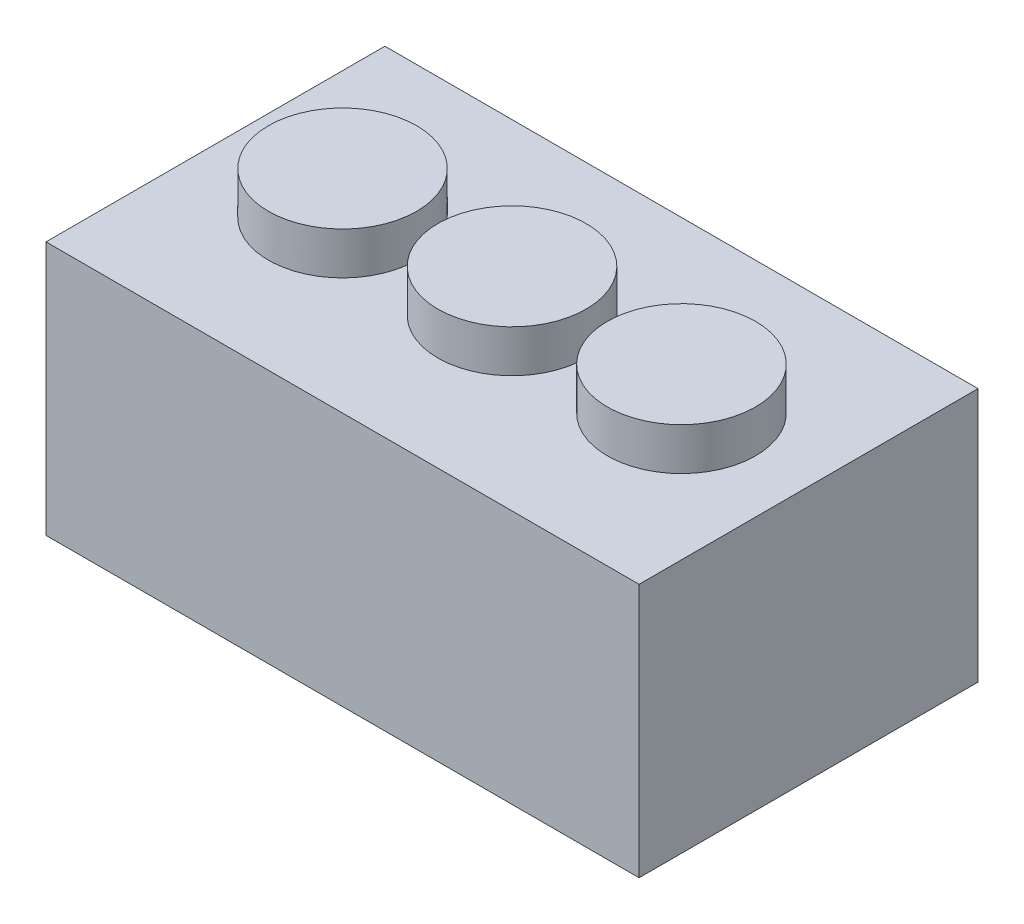
ISO-10303-21;
HEADER;
FILE_DESCRIPTION(('STEP AP214'),'2;1');
FILE_NAME('part.step','',(''),(''),'','','');
FILE_SCHEMA(('AUTOMOTIVE_DESIGN { 1 0 10303 214 1 1 1 1 }'));
ENDSEC;
DATA;
#1=APPLICATION_CONTEXT('core data for automotive mechanical design processes');
#2=APPLICATION_PROTOCOL_DEFINITION('international standard','automotive_design',2000,#1);
#3=PRODUCT_CONTEXT('',#1,'mechanical');
#4=PRODUCT('Part','Part','',(#3));
#5=PRODUCT_RELATED_PRODUCT_CATEGORY('part','',(#4));
#6=PRODUCT_DEFINITION_FORMATION('','',#4);
#7=PRODUCT_DEFINITION_CONTEXT('part definition',#1,'design');
#8=PRODUCT_DEFINITION('design','',#6,#7);
#9=PRODUCT_DEFINITION_SHAPE('','',#8);
#10=(LENGTH_UNIT() NAMED_UNIT(*) SI_UNIT(.MILLI.,.METRE.));
#11=(NAMED_UNIT(*) PLANE_ANGLE_UNIT() SI_UNIT($,.RADIAN.));
#12=(NAMED_UNIT(*) SI_UNIT($,.STERADIAN.) SOLID_ANGLE_UNIT());
#13=UNCERTAINTY_MEASURE_WITH_UNIT(LENGTH_MEASURE(1.E-05),#10,'distance_accuracy_value','');
#14=(GEOMETRIC_REPRESENTATION_CONTEXT(3) GLOBAL_UNCERTAINTY_ASSIGNED_CONTEXT((#13)) GLOBAL_UNIT_ASSIGNED_CONTEXT((#10,
#11,#12)) REPRESENTATION_CONTEXT('',''));
#15=CARTESIAN_POINT('',(0.,0.,0.));
#16=DIRECTION('',(0.,0.,1.));
#17=DIRECTION('',(1.,0.,0.));
#18=AXIS2_PLACEMENT_3D('',#15,#16,#17);
#19=CARTESIAN_POINT('',(68.,60.,40.));
#20=DIRECTION('',(-1.,0.,0.));
#21=DIRECTION('',(0.,0.,1.));
#22=AXIS2_PLACEMENT_3D('',#19,#20,#21);
#23=PLANE('',#22);
#24=DIRECTION('',(0.,0.,-1.));
#25=VECTOR('',#24,1.);
#26=CARTESIAN_POINT('',(68.,0.,0.));
#27=LINE('',#26,#25);
#28=CARTESIAN_POINT('',(68.,0.,-2.));
#29=VERTEX_POINT('',#28);
#30=CARTESIAN_POINT('',(68.,0.,-38.));
#31=VERTEX_POINT('',#30);
#32=EDGE_CURVE('E55',#29,#31,#27,.T.);
#33=ORIENTED_EDGE('',*,*,#32,.F.);
#34=DIRECTION('',(0.,1.,0.));
#35=VECTOR('',#34,1.);
#36=CARTESIAN_POINT('',(68.,-141.481447547019,-2.));
#37=LINE('',#36,#35);
#38=CARTESIAN_POINT('',(68.,58.,-2.));
#39=VERTEX_POINT('',#38);
#40=EDGE_CURVE('E186',#29,#39,#37,.T.);
#41=ORIENTED_EDGE('',*,*,#40,.T.);
#42=DIRECTION('',(0.,0.,-1.));
#43=VECTOR('',#42,1.);
#44=CARTESIAN_POINT('',(68.,58.,0.));
#45=LINE('',#44,#43);
#46=CARTESIAN_POINT('',(68.,58.,-38.));
#47=VERTEX_POINT('',#46);
#48=EDGE_CURVE('E290',#39,#47,#45,.T.);
#49=ORIENTED_EDGE('',*,*,#48,.T.);
#50=DIRECTION('',(0.,-1.,0.));
#51=VECTOR('',#50,1.);
#52=CARTESIAN_POINT('',(68.,60.,-38.));
#53=LINE('',#52,#51);
#54=EDGE_CURVE('E281',#47,#31,#53,.T.);
#55=ORIENTED_EDGE('',*,*,#54,.T.);
#56=EDGE_LOOP('',(#33,#41,#49,#55));
#57=FACE_BOUND('',#56,.T.);
#58=ADVANCED_FACE('F39',(#57),#23,.T.);
#59=CARTESIAN_POINT('',(68.,58.,38.));
#60=VERTEX_POINT('',#59);
#61=CARTESIAN_POINT('',(68.,58.,2.));
#62=VERTEX_POINT('',#61);
#63=EDGE_CURVE('E286',#60,#62,#45,.T.);
#64=ORIENTED_EDGE('',*,*,#63,.T.);
#65=DIRECTION('',(0.,1.,0.));
#66=VECTOR('',#65,1.);
#67=CARTESIAN_POINT('',(68.,-141.481447547019,2.));
#68=LINE('',#67,#66);
#69=CARTESIAN_POINT('',(68.,0.,2.));
#70=VERTEX_POINT('',#69);
#71=EDGE_CURVE('E63',#70,#62,#68,.T.);
#72=ORIENTED_EDGE('',*,*,#71,.F.);
#73=CARTESIAN_POINT('',(68.,0.,38.));
#74=VERTEX_POINT('',#73);
#75=EDGE_CURVE('E334',#74,#70,#27,.T.);
#76=ORIENTED_EDGE('',*,*,#75,.F.);
#77=DIRECTION('',(0.,-1.,0.));
#78=VECTOR('',#77,1.);
#79=CARTESIAN_POINT('',(68.,60.,38.));
#80=LINE('',#79,#78);
#81=EDGE_CURVE('E291',#60,#74,#80,.T.);
#82=ORIENTED_EDGE('',*,*,#81,.F.);
#83=EDGE_LOOP('',(#64,#72,#76,#82));
#84=FACE_BOUND('',#83,.T.);
#85=ADVANCED_FACE('F450',(#84),#23,.T.);
#86=CARTESIAN_POINT('',(-68.,60.,40.));
#87=DIRECTION('',(1.,0.,0.));
#88=DIRECTION('',(0.,0.,-1.));
#89=AXIS2_PLACEMENT_3D('',#86,#87,#88);
#90=PLANE('',#89);
#91=DIRECTION('',(0.,0.,1.));
#92=VECTOR('',#91,1.);
#93=CARTESIAN_POINT('',(-68.,58.,0.));
#94=LINE('',#93,#92);
#95=CARTESIAN_POINT('',(-68.,58.,-38.));
#96=VERTEX_POINT('',#95);
#97=CARTESIAN_POINT('',(-68.,58.,-2.));
#98=VERTEX_POINT('',#97);
#99=EDGE_CURVE('E305',#96,#98,#94,.T.);
#100=ORIENTED_EDGE('',*,*,#99,.T.);
#101=DIRECTION('',(0.,1.,0.));
#102=VECTOR('',#101,1.);
#103=CARTESIAN_POINT('',(-68.,-141.481447547019,-2.));
#104=LINE('',#103,#102);
#105=CARTESIAN_POINT('',(-68.,0.,-2.));
#106=VERTEX_POINT('',#105);
#107=EDGE_CURVE('E259',#106,#98,#104,.T.);
#108=ORIENTED_EDGE('',*,*,#107,.F.);
#109=DIRECTION('',(0.,0.,1.));
#110=VECTOR('',#109,1.);
#111=CARTESIAN_POINT('',(-68.,0.,0.));
#112=LINE('',#111,#110);
#113=CARTESIAN_POINT('',(-68.,0.,-38.));
#114=VERTEX_POINT('',#113);
#115=EDGE_CURVE('E342',#114,#106,#112,.T.);
#116=ORIENTED_EDGE('',*,*,#115,.F.);
#117=DIRECTION('',(0.,-1.,0.));
#118=VECTOR('',#117,1.);
#119=CARTESIAN_POINT('',(-68.,60.,-38.));
#120=LINE('',#119,#118);
#121=EDGE_CURVE('E285',#96,#114,#120,.T.);
#122=ORIENTED_EDGE('',*,*,#121,.F.);
#123=EDGE_LOOP('',(#100,#108,#116,#122));
#124=FACE_BOUND('',#123,.T.);
#125=ADVANCED_FACE('F455',(#124),#90,.T.);
#126=CARTESIAN_POINT('',(-68.,0.,2.));
#127=VERTEX_POINT('',#126);
#128=CARTESIAN_POINT('',(-68.,0.,38.));
#129=VERTEX_POINT('',#128);
#130=EDGE_CURVE('E345',#127,#129,#112,.T.);
#131=ORIENTED_EDGE('',*,*,#130,.F.);
#132=DIRECTION('',(0.,1.,0.));
#133=VECTOR('',#132,1.);
#134=CARTESIAN_POINT('',(-68.,-141.481447547019,2.));
#135=LINE('',#134,#133);
#136=CARTESIAN_POINT('',(-68.,58.,2.));
#137=VERTEX_POINT('',#136);
#138=EDGE_CURVE('E263',#127,#137,#135,.T.);
#139=ORIENTED_EDGE('',*,*,#138,.T.);
#140=CARTESIAN_POINT('',(-68.,58.,38.));
#141=VERTEX_POINT('',#140);
#142=EDGE_CURVE('E301',#137,#141,#94,.T.);
#143=ORIENTED_EDGE('',*,*,#142,.T.);
#144=DIRECTION('',(0.,-1.,0.));
#145=VECTOR('',#144,1.);
#146=CARTESIAN_POINT('',(-68.,60.,38.));
#147=LINE('',#146,#145);
#148=EDGE_CURVE('E294',#141,#129,#147,.T.);
#149=ORIENTED_EDGE('',*,*,#148,.T.);
#150=EDGE_LOOP('',(#131,#139,#143,#149));
#151=FACE_BOUND('',#150,.T.);
#152=ADVANCED_FACE('F468',(#151),#90,.T.);
#153=CARTESIAN_POINT('',(0.,58.,0.));
#154=DIRECTION('',(0.,-1.,0.));
#155=DIRECTION('',(0.,0.,-1.));
#156=AXIS2_PLACEMENT_3D('',#153,#154,#155);
#157=PLANE('',#156);
#158=ORIENTED_EDGE('',*,*,#48,.F.);
#159=DIRECTION('',(1.,0.,0.));
#160=VECTOR('',#159,1.);
#161=CARTESIAN_POINT('',(19.3971647412708,58.,-2.));
#162=LINE('',#161,#160);
#163=CARTESIAN_POINT('',(55.3704261489394,58.,-2.));
#164=VERTEX_POINT('',#163);
#165=EDGE_CURVE('E248',#164,#39,#162,.T.);
#166=ORIENTED_EDGE('',*,*,#165,.F.);
#167=CARTESIAN_POINT('',(40.,58.,0.));
#168=DIRECTION('',(0.,-1.,0.));
#169=DIRECTION('',(0.,0.,-1.));
#170=AXIS2_PLACEMENT_3D('',#167,#168,#169);
#171=CIRCLE('',#170,15.5);
#172=CARTESIAN_POINT('',(24.6295738510606,58.,-2.));
#173=VERTEX_POINT('',#172);
#174=EDGE_CURVE('E317',#164,#173,#171,.F.);
#175=ORIENTED_EDGE('',*,*,#174,.T.);
#176=CARTESIAN_POINT('',(19.3971647412708,58.,-2.));
#177=VERTEX_POINT('',#176);
#178=EDGE_CURVE('E249',#177,#173,#162,.T.);
#179=ORIENTED_EDGE('',*,*,#178,.F.);
#180=CARTESIAN_POINT('',(0.,58.,0.));
#181=DIRECTION('',(0.,-1.,0.));
#182=DIRECTION('',(0.,0.,-1.));
#183=AXIS2_PLACEMENT_3D('',#180,#181,#182);
#184=CIRCLE('',#183,19.5);
#185=CARTESIAN_POINT('',(-19.3971647412708,58.,-2.));
#186=VERTEX_POINT('',#185);
#187=EDGE_CURVE('E197',#186,#177,#184,.T.);
#188=ORIENTED_EDGE('',*,*,#187,.F.);
#189=DIRECTION('',(1.,0.,0.));
#190=VECTOR('',#189,1.);
#191=CARTESIAN_POINT('',(-68.,58.,-2.));
#192=LINE('',#191,#190);
#193=CARTESIAN_POINT('',(-24.6295738510606,58.,-2.));
#194=VERTEX_POINT('',#193);
#195=EDGE_CURVE('E239',#194,#186,#192,.T.);
#196=ORIENTED_EDGE('',*,*,#195,.F.);
#197=CARTESIAN_POINT('',(-40.,58.,0.));
#198=DIRECTION('',(0.,-1.,0.));
#199=DIRECTION('',(0.,0.,-1.));
#200=AXIS2_PLACEMENT_3D('',#197,#198,#199);
#201=CIRCLE('',#200,15.5);
#202=CARTESIAN_POINT('',(-55.3704261489394,58.,-2.));
#203=VERTEX_POINT('',#202);
#204=EDGE_CURVE('E284',#194,#203,#201,.F.);
#205=ORIENTED_EDGE('',*,*,#204,.T.);
#206=EDGE_CURVE('E241',#98,#203,#192,.T.);
#207=ORIENTED_EDGE('',*,*,#206,.F.);
#208=ORIENTED_EDGE('',*,*,#99,.F.);
#209=DIRECTION('',(-1.,0.,0.));
#210=VECTOR('',#209,1.);
#211=CARTESIAN_POINT('',(0.,58.,-38.));
#212=LINE('',#211,#210);
#213=EDGE_CURVE('E289',#47,#96,#212,.T.);
#214=ORIENTED_EDGE('',*,*,#213,.F.);
#215=EDGE_LOOP('',(#158,#166,#175,#179,#188,#196,#205,#207,#208,#214));
#216=FACE_BOUND('',#215,.T.);
#217=ADVANCED_FACE('F445',(#216),#157,.T.);
#218=ORIENTED_EDGE('',*,*,#142,.F.);
#219=DIRECTION('',(-1.,0.,0.));
#220=VECTOR('',#219,1.);
#221=CARTESIAN_POINT('',(-68.,58.,2.));
#222=LINE('',#221,#220);
#223=CARTESIAN_POINT('',(-55.3704261489394,58.,2.));
#224=VERTEX_POINT('',#223);
#225=EDGE_CURVE('E234',#224,#137,#222,.T.);
#226=ORIENTED_EDGE('',*,*,#225,.F.);
#227=CARTESIAN_POINT('',(-24.6295738510606,58.,2.));
#228=VERTEX_POINT('',#227);
#229=EDGE_CURVE('E322',#224,#228,#201,.F.);
#230=ORIENTED_EDGE('',*,*,#229,.T.);
#231=CARTESIAN_POINT('',(-19.3971647412708,58.,2.));
#232=VERTEX_POINT('',#231);
#233=EDGE_CURVE('E235',#232,#228,#222,.T.);
#234=ORIENTED_EDGE('',*,*,#233,.F.);
#235=CARTESIAN_POINT('',(0.,58.,0.));
#236=DIRECTION('',(0.,-1.,0.));
#237=DIRECTION('',(0.,0.,-1.));
#238=AXIS2_PLACEMENT_3D('',#235,#236,#237);
#239=CIRCLE('',#238,19.5);
#240=CARTESIAN_POINT('',(19.3971647412708,58.,2.));
#241=VERTEX_POINT('',#240);
#242=EDGE_CURVE('E229',#241,#232,#239,.T.);
#243=ORIENTED_EDGE('',*,*,#242,.F.);
#244=DIRECTION('',(-1.,0.,0.));
#245=VECTOR('',#244,1.);
#246=CARTESIAN_POINT('',(19.3971647412708,58.,2.));
#247=LINE('',#246,#245);
#248=CARTESIAN_POINT('',(24.6295738510606,58.,2.));
#249=VERTEX_POINT('',#248);
#250=EDGE_CURVE('E224',#249,#241,#247,.T.);
#251=ORIENTED_EDGE('',*,*,#250,.F.);
#252=CARTESIAN_POINT('',(55.3704261489394,58.,2.));
#253=VERTEX_POINT('',#252);
#254=EDGE_CURVE('E316',#249,#253,#171,.F.);
#255=ORIENTED_EDGE('',*,*,#254,.T.);
#256=EDGE_CURVE('E225',#62,#253,#247,.T.);
#257=ORIENTED_EDGE('',*,*,#256,.F.);
#258=ORIENTED_EDGE('',*,*,#63,.F.);
#259=DIRECTION('',(1.,0.,0.));
#260=VECTOR('',#259,1.);
#261=CARTESIAN_POINT('',(0.,58.,38.));
#262=LINE('',#261,#260);
#263=EDGE_CURVE('E295',#141,#60,#262,.T.);
#264=ORIENTED_EDGE('',*,*,#263,.F.);
#265=EDGE_LOOP('',(#218,#226,#230,#234,#243,#251,#255,#257,#258,#264));
#266=FACE_BOUND('',#265,.T.);
#267=ADVANCED_FACE('F438',(#266),#157,.T.);
#268=CARTESIAN_POINT('',(0.,0.,0.));
#269=DIRECTION('',(0.,-1.,0.));
#270=DIRECTION('',(0.,0.,-1.));
#271=AXIS2_PLACEMENT_3D('',#268,#269,#270);
#272=PLANE('',#271);
#273=ORIENTED_EDGE('',*,*,#75,.T.);
#274=DIRECTION('',(-1.,0.,0.));
#275=VECTOR('',#274,1.);
#276=CARTESIAN_POINT('',(19.3971647412708,0.,2.));
#277=LINE('',#276,#275);
#278=CARTESIAN_POINT('',(19.3971647412708,0.,2.));
#279=VERTEX_POINT('',#278);
#280=EDGE_CURVE('E220',#70,#279,#277,.T.);
#281=ORIENTED_EDGE('',*,*,#280,.T.);
#282=CARTESIAN_POINT('',(0.,0.,0.));
#283=DIRECTION('',(0.,-1.,0.));
#284=DIRECTION('',(0.,0.,-1.));
#285=AXIS2_PLACEMENT_3D('',#282,#283,#284);
#286=CIRCLE('',#285,19.5);
#287=CARTESIAN_POINT('',(-19.3971647412708,0.,2.));
#288=VERTEX_POINT('',#287);
#289=EDGE_CURVE('E216',#279,#288,#286,.T.);
#290=ORIENTED_EDGE('',*,*,#289,.T.);
#291=DIRECTION('',(-1.,0.,0.));
#292=VECTOR('',#291,1.);
#293=CARTESIAN_POINT('',(-68.,0.,2.));
#294=LINE('',#293,#292);
#295=EDGE_CURVE('E210',#288,#127,#294,.T.);
#296=ORIENTED_EDGE('',*,*,#295,.T.);
#297=ORIENTED_EDGE('',*,*,#130,.T.);
#298=DIRECTION('',(1.,0.,0.));
#299=VECTOR('',#298,1.);
#300=CARTESIAN_POINT('',(0.,0.,38.));
#301=LINE('',#300,#299);
#302=EDGE_CURVE('E338',#129,#74,#301,.T.);
#303=ORIENTED_EDGE('',*,*,#302,.T.);
#304=EDGE_LOOP('',(#273,#281,#290,#296,#297,#303));
#305=FACE_BOUND('',#304,.T.);
#306=DIRECTION('',(0.,0.,-1.));
#307=VECTOR('',#306,1.);
#308=CARTESIAN_POINT('',(70.,0.,40.));
#309=LINE('',#308,#307);
#310=CARTESIAN_POINT('',(70.,0.,40.));
#311=VERTEX_POINT('',#310);
#312=CARTESIAN_POINT('',(70.,0.,-40.));
#313=VERTEX_POINT('',#312);
#314=EDGE_CURVE('E360',#311,#313,#309,.T.);
#315=ORIENTED_EDGE('',*,*,#314,.F.);
#316=DIRECTION('',(1.,0.,0.));
#317=VECTOR('',#316,1.);
#318=CARTESIAN_POINT('',(-70.,0.,40.));
#319=LINE('',#318,#317);
#320=CARTESIAN_POINT('',(-70.,0.,40.));
#321=VERTEX_POINT('',#320);
#322=EDGE_CURVE('E371',#321,#311,#319,.T.);
#323=ORIENTED_EDGE('',*,*,#322,.F.);
#324=DIRECTION('',(0.,0.,1.));
#325=VECTOR('',#324,1.);
#326=CARTESIAN_POINT('',(-70.,0.,40.));
#327=LINE('',#326,#325);
#328=CARTESIAN_POINT('',(-70.,0.,-40.));
#329=VERTEX_POINT('',#328);
#330=EDGE_CURVE('E387',#329,#321,#327,.T.);
#331=ORIENTED_EDGE('',*,*,#330,.F.);
#332=DIRECTION('',(-1.,0.,0.));
#333=VECTOR('',#332,1.);
#334=CARTESIAN_POINT('',(-70.,0.,-40.));
#335=LINE('',#334,#333);
#336=EDGE_CURVE('E384',#313,#329,#335,.T.);
#337=ORIENTED_EDGE('',*,*,#336,.F.);
#338=EDGE_LOOP('',(#315,#323,#331,#337));
#339=FACE_BOUND('',#338,.T.);
#340=DIRECTION('',(1.,0.,0.));
#341=VECTOR('',#340,1.);
#342=CARTESIAN_POINT('',(19.3971647412708,0.,-2.));
#343=LINE('',#342,#341);
#344=CARTESIAN_POINT('',(19.3971647412708,0.,-2.));
#345=VERTEX_POINT('',#344);
#346=EDGE_CURVE('E179',#345,#29,#343,.T.);
#347=ORIENTED_EDGE('',*,*,#346,.T.);
#348=ORIENTED_EDGE('',*,*,#32,.T.);
#349=DIRECTION('',(-1.,0.,0.));
#350=VECTOR('',#349,1.);
#351=CARTESIAN_POINT('',(0.,0.,-38.));
#352=LINE('',#351,#350);
#353=EDGE_CURVE('E337',#31,#114,#352,.T.);
#354=ORIENTED_EDGE('',*,*,#353,.T.);
#355=ORIENTED_EDGE('',*,*,#115,.T.);
#356=DIRECTION('',(1.,0.,0.));
#357=VECTOR('',#356,1.);
#358=CARTESIAN_POINT('',(-68.,0.,-2.));
#359=LINE('',#358,#357);
#360=CARTESIAN_POINT('',(-19.3971647412708,0.,-2.));
#361=VERTEX_POINT('',#360);
#362=EDGE_CURVE('E206',#106,#361,#359,.T.);
#363=ORIENTED_EDGE('',*,*,#362,.T.);
#364=CARTESIAN_POINT('',(0.,0.,0.));
#365=DIRECTION('',(0.,-1.,0.));
#366=DIRECTION('',(0.,0.,-1.));
#367=AXIS2_PLACEMENT_3D('',#364,#365,#366);
#368=CIRCLE('',#367,19.5);
#369=EDGE_CURVE('E190',#361,#345,#368,.T.);
#370=ORIENTED_EDGE('',*,*,#369,.T.);
#371=EDGE_LOOP('',(#347,#348,#354,#355,#363,#370));
#372=FACE_BOUND('',#371,.T.);
#373=CARTESIAN_POINT('',(0.,0.,0.));
#374=DIRECTION('',(0.,-1.,0.));
#375=DIRECTION('',(0.,0.,-1.));
#376=AXIS2_PLACEMENT_3D('',#373,#374,#375);
#377=CIRCLE('',#376,15.5);
#378=CARTESIAN_POINT('',(0.,0.,-15.5));
#379=VERTEX_POINT('',#378);
#380=EDGE_CURVE('E191',#379,#379,#377,.T.);
#381=ORIENTED_EDGE('',*,*,#380,.F.);
#382=EDGE_LOOP('',(#381));
#383=FACE_BOUND('',#382,.T.);
#384=ADVANCED_FACE('F202',(#305,#339,#372,#383),#272,.T.);
#385=CARTESIAN_POINT('',(70.,60.,40.));
#386=DIRECTION('',(-1.,0.,0.));
#387=DIRECTION('',(0.,0.,1.));
#388=AXIS2_PLACEMENT_3D('',#385,#386,#387);
#389=PLANE('',#388);
#390=ORIENTED_EDGE('',*,*,#314,.T.);
#391=DIRECTION('',(0.,-1.,0.));
#392=VECTOR('',#391,1.);
#393=CARTESIAN_POINT('',(70.,60.,-40.));
#394=LINE('',#393,#392);
#395=CARTESIAN_POINT('',(70.,60.,-40.));
#396=VERTEX_POINT('',#395);
#397=EDGE_CURVE('E365',#396,#313,#394,.T.);
#398=ORIENTED_EDGE('',*,*,#397,.F.);
#399=DIRECTION('',(0.,0.,-1.));
#400=VECTOR('',#399,1.);
#401=CARTESIAN_POINT('',(70.,60.,40.));
#402=LINE('',#401,#400);
#403=CARTESIAN_POINT('',(70.,60.,40.));
#404=VERTEX_POINT('',#403);
#405=EDGE_CURVE('E366',#404,#396,#402,.T.);
#406=ORIENTED_EDGE('',*,*,#405,.F.);
#407=DIRECTION('',(0.,-1.,0.));
#408=VECTOR('',#407,1.);
#409=CARTESIAN_POINT('',(70.,60.,40.));
#410=LINE('',#409,#408);
#411=EDGE_CURVE('E380',#404,#311,#410,.T.);
#412=ORIENTED_EDGE('',*,*,#411,.T.);
#413=EDGE_LOOP('',(#390,#398,#406,#412));
#414=FACE_BOUND('',#413,.T.);
#415=ADVANCED_FACE('F41',(#414),#389,.F.);
#416=CARTESIAN_POINT('',(-70.,60.,-40.));
#417=DIRECTION('',(0.,0.,1.));
#418=DIRECTION('',(1.,0.,0.));
#419=AXIS2_PLACEMENT_3D('',#416,#417,#418);
#420=PLANE('',#419);
#421=ORIENTED_EDGE('',*,*,#336,.T.);
#422=DIRECTION('',(0.,-1.,0.));
#423=VECTOR('',#422,1.);
#424=CARTESIAN_POINT('',(-70.,60.,-40.));
#425=LINE('',#424,#423);
#426=CARTESIAN_POINT('',(-70.,60.,-40.));
#427=VERTEX_POINT('',#426);
#428=EDGE_CURVE('E399',#427,#329,#425,.T.);
#429=ORIENTED_EDGE('',*,*,#428,.F.);
#430=DIRECTION('',(-1.,0.,0.));
#431=VECTOR('',#430,1.);
#432=CARTESIAN_POINT('',(-70.,60.,-40.));
#433=LINE('',#432,#431);
#434=EDGE_CURVE('E370',#396,#427,#433,.T.);
#435=ORIENTED_EDGE('',*,*,#434,.F.);
#436=ORIENTED_EDGE('',*,*,#397,.T.);
#437=EDGE_LOOP('',(#421,#429,#435,#436));
#438=FACE_BOUND('',#437,.T.);
#439=ADVANCED_FACE('F428',(#438),#420,.F.);
#440=CARTESIAN_POINT('',(-70.,60.,40.));
#441=DIRECTION('',(1.,0.,0.));
#442=DIRECTION('',(0.,0.,-1.));
#443=AXIS2_PLACEMENT_3D('',#440,#441,#442);
#444=PLANE('',#443);
#445=ORIENTED_EDGE('',*,*,#330,.T.);
#446=DIRECTION('',(0.,-1.,0.));
#447=VECTOR('',#446,1.);
#448=CARTESIAN_POINT('',(-70.,60.,40.));
#449=LINE('',#448,#447);
#450=CARTESIAN_POINT('',(-70.,60.,40.));
#451=VERTEX_POINT('',#450);
#452=EDGE_CURVE('E395',#451,#321,#449,.T.);
#453=ORIENTED_EDGE('',*,*,#452,.F.);
#454=DIRECTION('',(0.,0.,1.));
#455=VECTOR('',#454,1.);
#456=CARTESIAN_POINT('',(-70.,60.,40.));
#457=LINE('',#456,#455);
#458=EDGE_CURVE('E374',#427,#451,#457,.T.);
#459=ORIENTED_EDGE('',*,*,#458,.F.);
#460=ORIENTED_EDGE('',*,*,#428,.T.);
#461=EDGE_LOOP('',(#445,#453,#459,#460));
#462=FACE_BOUND('',#461,.T.);
#463=ADVANCED_FACE('F433',(#462),#444,.F.);
#464=CARTESIAN_POINT('',(-70.,60.,40.));
#465=DIRECTION('',(0.,0.,-1.));
#466=DIRECTION('',(-1.,0.,0.));
#467=AXIS2_PLACEMENT_3D('',#464,#465,#466);
#468=PLANE('',#467);
#469=ORIENTED_EDGE('',*,*,#322,.T.);
#470=ORIENTED_EDGE('',*,*,#411,.F.);
#471=DIRECTION('',(1.,0.,0.));
#472=VECTOR('',#471,1.);
#473=CARTESIAN_POINT('',(-70.,60.,40.));
#474=LINE('',#473,#472);
#475=EDGE_CURVE('E377',#451,#404,#474,.T.);
#476=ORIENTED_EDGE('',*,*,#475,.F.);
#477=ORIENTED_EDGE('',*,*,#452,.T.);
#478=EDGE_LOOP('',(#469,#470,#476,#477));
#479=FACE_BOUND('',#478,.T.);
#480=ADVANCED_FACE('F415',(#479),#468,.F.);
#481=CARTESIAN_POINT('',(0.,60.,0.));
#482=DIRECTION('',(0.,-1.,0.));
#483=DIRECTION('',(0.,0.,-1.));
#484=AXIS2_PLACEMENT_3D('',#481,#482,#483);
#485=PLANE('',#484);
#486=CARTESIAN_POINT('',(40.,60.,0.));
#487=DIRECTION('',(0.,-1.,0.));
#488=DIRECTION('',(0.,0.,-1.));
#489=AXIS2_PLACEMENT_3D('',#486,#487,#488);
#490=CIRCLE('',#489,17.5);
#491=CARTESIAN_POINT('',(40.,60.,-17.5));
#492=VERTEX_POINT('',#491);
#493=EDGE_CURVE('E11',#492,#492,#490,.F.);
#494=ORIENTED_EDGE('',*,*,#493,.F.);
#495=EDGE_LOOP('',(#494));
#496=FACE_BOUND('',#495,.T.);
#497=CARTESIAN_POINT('',(-40.,60.,0.));
#498=DIRECTION('',(0.,-1.,0.));
#499=DIRECTION('',(0.,0.,-1.));
#500=AXIS2_PLACEMENT_3D('',#497,#498,#499);
#501=CIRCLE('',#500,17.5);
#502=CARTESIAN_POINT('',(-40.,60.,-17.5));
#503=VERTEX_POINT('',#502);
#504=EDGE_CURVE('E48',#503,#503,#501,.F.);
#505=ORIENTED_EDGE('',*,*,#504,.F.);
#506=EDGE_LOOP('',(#505));
#507=FACE_BOUND('',#506,.T.);
#508=CARTESIAN_POINT('',(0.,60.,0.));
#509=DIRECTION('',(0.,1.,0.));
#510=DIRECTION('',(0.,0.,1.));
#511=AXIS2_PLACEMENT_3D('',#508,#509,#510);
#512=CIRCLE('',#511,17.5);
#513=CARTESIAN_POINT('',(0.,60.,17.5));
#514=VERTEX_POINT('',#513);
#515=EDGE_CURVE('E361',#514,#514,#512,.T.);
#516=ORIENTED_EDGE('',*,*,#515,.F.);
#517=EDGE_LOOP('',(#516));
#518=FACE_BOUND('',#517,.T.);
#519=ORIENTED_EDGE('',*,*,#405,.T.);
#520=ORIENTED_EDGE('',*,*,#434,.T.);
#521=ORIENTED_EDGE('',*,*,#458,.T.);
#522=ORIENTED_EDGE('',*,*,#475,.T.);
#523=EDGE_LOOP('',(#519,#520,#521,#522));
#524=FACE_BOUND('',#523,.T.);
#525=ADVANCED_FACE('F411',(#496,#507,#518,#524),#485,.F.);
#526=CARTESIAN_POINT('',(0.,70.,0.));
#527=DIRECTION('',(0.,-1.,0.));
#528=DIRECTION('',(0.,0.,-1.));
#529=AXIS2_PLACEMENT_3D('',#526,#527,#528);
#530=CYLINDRICAL_SURFACE('',#529,17.5);
#531=CARTESIAN_POINT('',(0.,70.,0.));
#532=DIRECTION('',(0.,1.,0.));
#533=DIRECTION('',(0.,0.,1.));
#534=AXIS2_PLACEMENT_3D('',#531,#532,#533);
#535=CIRCLE('',#534,17.5);
#536=CARTESIAN_POINT('',(0.,70.,17.5));
#537=VERTEX_POINT('',#536);
#538=EDGE_CURVE('E356',#537,#537,#535,.T.);
#539=ORIENTED_EDGE('',*,*,#538,.F.);
#540=EDGE_LOOP('',(#539));
#541=FACE_BOUND('',#540,.T.);
#542=ORIENTED_EDGE('',*,*,#515,.T.);
#543=EDGE_LOOP('',(#542));
#544=FACE_BOUND('',#543,.T.);
#545=ADVANCED_FACE('F414',(#541,#544),#530,.T.);
#546=CARTESIAN_POINT('',(0.,70.,0.));
#547=DIRECTION('',(0.,1.,0.));
#548=DIRECTION('',(0.,0.,1.));
#549=AXIS2_PLACEMENT_3D('',#546,#547,#548);
#550=PLANE('',#549);
#551=ORIENTED_EDGE('',*,*,#538,.T.);
#552=EDGE_LOOP('',(#551));
#553=FACE_BOUND('',#552,.T.);
#554=ADVANCED_FACE('F513',(#553),#550,.T.);
#555=CARTESIAN_POINT('',(-40.,70.,0.));
#556=DIRECTION('',(0.,-1.,0.));
#557=DIRECTION('',(0.,0.,-1.));
#558=AXIS2_PLACEMENT_3D('',#555,#556,#557);
#559=CYLINDRICAL_SURFACE('',#558,17.5);
#560=CARTESIAN_POINT('',(-40.,70.,0.));
#561=DIRECTION('',(0.,1.,0.));
#562=DIRECTION('',(0.,0.,1.));
#563=AXIS2_PLACEMENT_3D('',#560,#561,#562);
#564=CIRCLE('',#563,17.5);
#565=CARTESIAN_POINT('',(-40.,70.,17.5));
#566=VERTEX_POINT('',#565);
#567=EDGE_CURVE('E352',#566,#566,#564,.T.);
#568=ORIENTED_EDGE('',*,*,#567,.F.);
#569=EDGE_LOOP('',(#568));
#570=FACE_BOUND('',#569,.T.);
#571=ORIENTED_EDGE('',*,*,#504,.T.);
#572=EDGE_LOOP('',(#571));
#573=FACE_BOUND('',#572,.T.);
#574=ADVANCED_FACE('F409',(#570,#573),#559,.T.);
#575=CARTESIAN_POINT('',(-40.,70.,0.));
#576=DIRECTION('',(0.,1.,0.));
#577=DIRECTION('',(0.,0.,1.));
#578=AXIS2_PLACEMENT_3D('',#575,#576,#577);
#579=PLANE('',#578);
#580=ORIENTED_EDGE('',*,*,#567,.T.);
#581=EDGE_LOOP('',(#580));
#582=FACE_BOUND('',#581,.T.);
#583=ADVANCED_FACE('F506',(#582),#579,.T.);
#584=CARTESIAN_POINT('',(40.,70.,0.));
#585=DIRECTION('',(0.,-1.,0.));
#586=DIRECTION('',(0.,0.,-1.));
#587=AXIS2_PLACEMENT_3D('',#584,#585,#586);
#588=CYLINDRICAL_SURFACE('',#587,17.5);
#589=CARTESIAN_POINT('',(40.,70.,0.));
#590=DIRECTION('',(0.,1.,0.));
#591=DIRECTION('',(0.,0.,-1.));
#592=AXIS2_PLACEMENT_3D('',#589,#590,#591);
#593=CIRCLE('',#592,17.5);
#594=CARTESIAN_POINT('',(40.,70.,-17.5));
#595=VERTEX_POINT('',#594);
#596=EDGE_CURVE('E315',#595,#595,#593,.T.);
#597=ORIENTED_EDGE('',*,*,#596,.F.);
#598=EDGE_LOOP('',(#597));
#599=FACE_BOUND('',#598,.T.);
#600=ORIENTED_EDGE('',*,*,#493,.T.);
#601=EDGE_LOOP('',(#600));
#602=FACE_BOUND('',#601,.T.);
#603=ADVANCED_FACE('F502',(#599,#602),#588,.T.);
#604=CARTESIAN_POINT('',(40.,70.,0.));
#605=DIRECTION('',(0.,-1.,0.));
#606=DIRECTION('',(0.,0.,-1.));
#607=AXIS2_PLACEMENT_3D('',#604,#605,#606);
#608=PLANE('',#607);
#609=ORIENTED_EDGE('',*,*,#596,.T.);
#610=EDGE_LOOP('',(#609));
#611=FACE_BOUND('',#610,.T.);
#612=ADVANCED_FACE('F464',(#611),#608,.F.);
#613=CARTESIAN_POINT('',(-70.,60.,-38.));
#614=DIRECTION('',(0.,0.,1.));
#615=DIRECTION('',(1.,0.,0.));
#616=AXIS2_PLACEMENT_3D('',#613,#614,#615);
#617=PLANE('',#616);
#618=ORIENTED_EDGE('',*,*,#353,.F.);
#619=ORIENTED_EDGE('',*,*,#54,.F.);
#620=ORIENTED_EDGE('',*,*,#213,.T.);
#621=ORIENTED_EDGE('',*,*,#121,.T.);
#622=EDGE_LOOP('',(#618,#619,#620,#621));
#623=FACE_BOUND('',#622,.T.);
#624=ADVANCED_FACE('F460',(#623),#617,.T.);
#625=CARTESIAN_POINT('',(-70.,60.,38.));
#626=DIRECTION('',(0.,0.,-1.));
#627=DIRECTION('',(-1.,0.,0.));
#628=AXIS2_PLACEMENT_3D('',#625,#626,#627);
#629=PLANE('',#628);
#630=ORIENTED_EDGE('',*,*,#302,.F.);
#631=ORIENTED_EDGE('',*,*,#148,.F.);
#632=ORIENTED_EDGE('',*,*,#263,.T.);
#633=ORIENTED_EDGE('',*,*,#81,.T.);
#634=EDGE_LOOP('',(#630,#631,#632,#633));
#635=FACE_BOUND('',#634,.T.);
#636=ADVANCED_FACE('F463',(#635),#629,.T.);
#637=CARTESIAN_POINT('',(-40.,70.,0.));
#638=DIRECTION('',(0.,-1.,0.));
#639=DIRECTION('',(0.,0.,-1.));
#640=AXIS2_PLACEMENT_3D('',#637,#638,#639);
#641=CYLINDRICAL_SURFACE('',#640,15.5);
#642=CARTESIAN_POINT('',(-40.,68.,0.));
#643=DIRECTION('',(0.,1.,0.));
#644=DIRECTION('',(0.,0.,1.));
#645=AXIS2_PLACEMENT_3D('',#642,#643,#644);
#646=CIRCLE('',#645,15.5);
#647=CARTESIAN_POINT('',(-40.,68.,15.5));
#648=VERTEX_POINT('',#647);
#649=EDGE_CURVE('E327',#648,#648,#646,.T.);
#650=ORIENTED_EDGE('',*,*,#649,.T.);
#651=EDGE_LOOP('',(#650));
#652=FACE_BOUND('',#651,.T.);
#653=EDGE_CURVE('E318',#203,#224,#201,.F.);
#654=ORIENTED_EDGE('',*,*,#653,.F.);
#655=ORIENTED_EDGE('',*,*,#204,.F.);
#656=CARTESIAN_POINT('',(-40.,58.,0.));
#657=DIRECTION('',(0.,-1.,0.));
#658=DIRECTION('',(0.,0.,-1.));
#659=AXIS2_PLACEMENT_3D('',#656,#657,#658);
#660=CIRCLE('',#659,15.5);
#661=EDGE_CURVE('E274',#194,#228,#660,.T.);
#662=ORIENTED_EDGE('',*,*,#661,.T.);
#663=ORIENTED_EDGE('',*,*,#229,.F.);
#664=EDGE_LOOP('',(#654,#655,#662,#663));
#665=FACE_BOUND('',#664,.T.);
#666=ADVANCED_FACE('F471',(#652,#665),#641,.F.);
#667=CARTESIAN_POINT('',(-40.,68.,0.));
#668=DIRECTION('',(0.,1.,0.));
#669=DIRECTION('',(0.,0.,1.));
#670=AXIS2_PLACEMENT_3D('',#667,#668,#669);
#671=PLANE('',#670);
#672=ORIENTED_EDGE('',*,*,#649,.F.);
#673=EDGE_LOOP('',(#672));
#674=FACE_BOUND('',#673,.T.);
#675=ADVANCED_FACE('F486',(#674),#671,.F.);
#676=CARTESIAN_POINT('',(40.,70.,0.));
#677=DIRECTION('',(0.,-1.,0.));
#678=DIRECTION('',(0.,0.,-1.));
#679=AXIS2_PLACEMENT_3D('',#676,#677,#678);
#680=CYLINDRICAL_SURFACE('',#679,15.5);
#681=CARTESIAN_POINT('',(40.,68.,0.));
#682=DIRECTION('',(0.,-1.,0.));
#683=DIRECTION('',(0.,0.,-1.));
#684=AXIS2_PLACEMENT_3D('',#681,#682,#683);
#685=CIRCLE('',#684,15.5);
#686=CARTESIAN_POINT('',(40.,68.,-15.5));
#687=VERTEX_POINT('',#686);
#688=EDGE_CURVE('E280',#687,#687,#685,.F.);
#689=ORIENTED_EDGE('',*,*,#688,.T.);
#690=EDGE_LOOP('',(#689));
#691=FACE_BOUND('',#690,.T.);
#692=EDGE_CURVE('E311',#173,#249,#171,.F.);
#693=ORIENTED_EDGE('',*,*,#692,.F.);
#694=ORIENTED_EDGE('',*,*,#174,.F.);
#695=EDGE_CURVE('E745',#253,#164,#171,.F.);
#696=ORIENTED_EDGE('',*,*,#695,.F.);
#697=ORIENTED_EDGE('',*,*,#254,.F.);
#698=EDGE_LOOP('',(#693,#694,#696,#697));
#699=FACE_BOUND('',#698,.T.);
#700=ADVANCED_FACE('F490',(#691,#699),#680,.F.);
#701=CARTESIAN_POINT('',(40.,68.,0.));
#702=DIRECTION('',(0.,-1.,0.));
#703=DIRECTION('',(0.,0.,-1.));
#704=AXIS2_PLACEMENT_3D('',#701,#702,#703);
#705=PLANE('',#704);
#706=ORIENTED_EDGE('',*,*,#688,.F.);
#707=EDGE_LOOP('',(#706));
#708=FACE_BOUND('',#707,.T.);
#709=ADVANCED_FACE('F494',(#708),#705,.T.);
#710=CARTESIAN_POINT('',(0.,58.,0.));
#711=DIRECTION('',(0.,-1.,0.));
#712=DIRECTION('',(0.,0.,-1.));
#713=AXIS2_PLACEMENT_3D('',#710,#711,#712);
#714=PLANE('',#713);
#715=ORIENTED_EDGE('',*,*,#661,.F.);
#716=EDGE_CURVE('E245',#203,#194,#192,.T.);
#717=ORIENTED_EDGE('',*,*,#716,.F.);
#718=ORIENTED_EDGE('',*,*,#653,.T.);
#719=EDGE_CURVE('E240',#228,#224,#222,.T.);
#720=ORIENTED_EDGE('',*,*,#719,.F.);
#721=EDGE_LOOP('',(#715,#717,#718,#720));
#722=FACE_BOUND('',#721,.T.);
#723=ADVANCED_FACE('F498',(#722),#714,.F.);
#724=ORIENTED_EDGE('',*,*,#695,.T.);
#725=EDGE_CURVE('E252',#173,#164,#162,.T.);
#726=ORIENTED_EDGE('',*,*,#725,.F.);
#727=ORIENTED_EDGE('',*,*,#692,.T.);
#728=EDGE_CURVE('E230',#253,#249,#247,.T.);
#729=ORIENTED_EDGE('',*,*,#728,.F.);
#730=EDGE_LOOP('',(#724,#726,#727,#729));
#731=FACE_BOUND('',#730,.T.);
#732=ADVANCED_FACE('F578',(#731),#714,.F.);
#733=CARTESIAN_POINT('',(19.3971647412708,-141.481447547019,-2.));
#734=DIRECTION('',(0.,0.,1.));
#735=DIRECTION('',(1.,0.,0.));
#736=AXIS2_PLACEMENT_3D('',#733,#734,#735);
#737=PLANE('',#736);
#738=ORIENTED_EDGE('',*,*,#346,.F.);
#739=DIRECTION('',(0.,1.,0.));
#740=VECTOR('',#739,1.);
#741=CARTESIAN_POINT('',(19.3971647412708,-141.481447547019,-2.));
#742=LINE('',#741,#740);
#743=EDGE_CURVE('E183',#345,#177,#742,.T.);
#744=ORIENTED_EDGE('',*,*,#743,.T.);
#745=ORIENTED_EDGE('',*,*,#178,.T.);
#746=ORIENTED_EDGE('',*,*,#725,.T.);
#747=ORIENTED_EDGE('',*,*,#165,.T.);
#748=ORIENTED_EDGE('',*,*,#40,.F.);
#749=EDGE_LOOP('',(#738,#744,#745,#746,#747,#748));
#750=FACE_BOUND('',#749,.T.);
#751=ADVANCED_FACE('F181',(#750),#737,.F.);
#752=CARTESIAN_POINT('',(0.,-141.481447547019,0.));
#753=DIRECTION('',(0.,1.,0.));
#754=DIRECTION('',(0.,0.,1.));
#755=AXIS2_PLACEMENT_3D('',#752,#753,#754);
#756=CYLINDRICAL_SURFACE('',#755,19.5);
#757=ORIENTED_EDGE('',*,*,#369,.F.);
#758=DIRECTION('',(0.,1.,0.));
#759=VECTOR('',#758,1.);
#760=CARTESIAN_POINT('',(-19.3971647412708,-141.481447547019,-2.));
#761=LINE('',#760,#759);
#762=EDGE_CURVE('E199',#361,#186,#761,.T.);
#763=ORIENTED_EDGE('',*,*,#762,.T.);
#764=ORIENTED_EDGE('',*,*,#187,.T.);
#765=ORIENTED_EDGE('',*,*,#743,.F.);
#766=EDGE_LOOP('',(#757,#763,#764,#765));
#767=FACE_BOUND('',#766,.T.);
#768=ADVANCED_FACE('F194',(#767),#756,.T.);
#769=CARTESIAN_POINT('',(-68.,-141.481447547019,-2.));
#770=DIRECTION('',(0.,0.,1.));
#771=DIRECTION('',(1.,0.,0.));
#772=AXIS2_PLACEMENT_3D('',#769,#770,#771);
#773=PLANE('',#772);
#774=ORIENTED_EDGE('',*,*,#362,.F.);
#775=ORIENTED_EDGE('',*,*,#107,.T.);
#776=ORIENTED_EDGE('',*,*,#206,.T.);
#777=ORIENTED_EDGE('',*,*,#716,.T.);
#778=ORIENTED_EDGE('',*,*,#195,.T.);
#779=ORIENTED_EDGE('',*,*,#762,.F.);
#780=EDGE_LOOP('',(#774,#775,#776,#777,#778,#779));
#781=FACE_BOUND('',#780,.T.);
#782=ADVANCED_FACE('F598',(#781),#773,.F.);
#783=CARTESIAN_POINT('',(-68.,-141.481447547019,2.));
#784=DIRECTION('',(0.,0.,-1.));
#785=DIRECTION('',(-1.,0.,0.));
#786=AXIS2_PLACEMENT_3D('',#783,#784,#785);
#787=PLANE('',#786);
#788=ORIENTED_EDGE('',*,*,#295,.F.);
#789=DIRECTION('',(0.,1.,0.));
#790=VECTOR('',#789,1.);
#791=CARTESIAN_POINT('',(-19.3971647412708,-141.481447547019,2.));
#792=LINE('',#791,#790);
#793=EDGE_CURVE('E266',#288,#232,#792,.T.);
#794=ORIENTED_EDGE('',*,*,#793,.T.);
#795=ORIENTED_EDGE('',*,*,#233,.T.);
#796=ORIENTED_EDGE('',*,*,#719,.T.);
#797=ORIENTED_EDGE('',*,*,#225,.T.);
#798=ORIENTED_EDGE('',*,*,#138,.F.);
#799=EDGE_LOOP('',(#788,#794,#795,#796,#797,#798));
#800=FACE_BOUND('',#799,.T.);
#801=ADVANCED_FACE('F605',(#800),#787,.F.);
#802=CARTESIAN_POINT('',(0.,-141.481447547019,0.));
#803=DIRECTION('',(0.,1.,0.));
#804=DIRECTION('',(0.,0.,1.));
#805=AXIS2_PLACEMENT_3D('',#802,#803,#804);
#806=CYLINDRICAL_SURFACE('',#805,19.5);
#807=ORIENTED_EDGE('',*,*,#289,.F.);
#808=DIRECTION('',(0.,1.,0.));
#809=VECTOR('',#808,1.);
#810=CARTESIAN_POINT('',(19.3971647412708,-141.481447547019,2.));
#811=LINE('',#810,#809);
#812=EDGE_CURVE('E270',#279,#241,#811,.T.);
#813=ORIENTED_EDGE('',*,*,#812,.T.);
#814=ORIENTED_EDGE('',*,*,#242,.T.);
#815=ORIENTED_EDGE('',*,*,#793,.F.);
#816=EDGE_LOOP('',(#807,#813,#814,#815));
#817=FACE_BOUND('',#816,.T.);
#818=ADVANCED_FACE('F613',(#817),#806,.T.);
#819=CARTESIAN_POINT('',(19.3971647412708,-141.481447547019,2.));
#820=DIRECTION('',(0.,0.,-1.));
#821=DIRECTION('',(-1.,0.,0.));
#822=AXIS2_PLACEMENT_3D('',#819,#820,#821);
#823=PLANE('',#822);
#824=ORIENTED_EDGE('',*,*,#280,.F.);
#825=ORIENTED_EDGE('',*,*,#71,.T.);
#826=ORIENTED_EDGE('',*,*,#256,.T.);
#827=ORIENTED_EDGE('',*,*,#728,.T.);
#828=ORIENTED_EDGE('',*,*,#250,.T.);
#829=ORIENTED_EDGE('',*,*,#812,.F.);
#830=EDGE_LOOP('',(#824,#825,#826,#827,#828,#829));
#831=FACE_BOUND('',#830,.T.);
#832=ADVANCED_FACE('F458',(#831),#823,.F.);
#833=CARTESIAN_POINT('',(0.,68.,0.));
#834=DIRECTION('',(0.,1.,0.));
#835=DIRECTION('',(0.,0.,1.));
#836=AXIS2_PLACEMENT_3D('',#833,#834,#835);
#837=PLANE('',#836);
#838=CARTESIAN_POINT('',(0.,68.,0.));
#839=DIRECTION('',(0.,1.,0.));
#840=DIRECTION('',(0.,0.,1.));
#841=AXIS2_PLACEMENT_3D('',#838,#839,#840);
#842=CIRCLE('',#841,15.5);
#843=CARTESIAN_POINT('',(0.,68.,15.5));
#844=VERTEX_POINT('',#843);
#845=EDGE_CURVE('E323',#844,#844,#842,.T.);
#846=ORIENTED_EDGE('',*,*,#845,.F.);
#847=EDGE_LOOP('',(#846));
#848=FACE_BOUND('',#847,.T.);
#849=ADVANCED_FACE('F479',(#848),#837,.F.);
#850=CARTESIAN_POINT('',(0.,70.,0.));
#851=DIRECTION('',(0.,-1.,0.));
#852=DIRECTION('',(0.,0.,-1.));
#853=AXIS2_PLACEMENT_3D('',#850,#851,#852);
#854=CYLINDRICAL_SURFACE('',#853,15.5);
#855=ORIENTED_EDGE('',*,*,#845,.T.);
#856=EDGE_LOOP('',(#855));
#857=FACE_BOUND('',#856,.T.);
#858=ORIENTED_EDGE('',*,*,#380,.T.);
#859=EDGE_LOOP('',(#858));
#860=FACE_BOUND('',#859,.T.);
#861=ADVANCED_FACE('F476',(#857,#860),#854,.F.);
#862=CLOSED_SHELL('',(#58,#85,#125,#152,#217,#267,#384,#415,#439,#463,#480,#525,#545,#554,#574,
#583,#603,#612,#624,#636,#666,#675,#700,#709,#723,#732,#751,#768,#782,#801,#818,#832,#849,#861));
#863=MANIFOLD_SOLID_BREP('B2',#862);
#864=ADVANCED_BREP_SHAPE_REPRESENTATION('',(#18,#863),#14);
#865=SHAPE_DEFINITION_REPRESENTATION(#9,#864);
ENDSEC;
END-ISO-10303-21;
